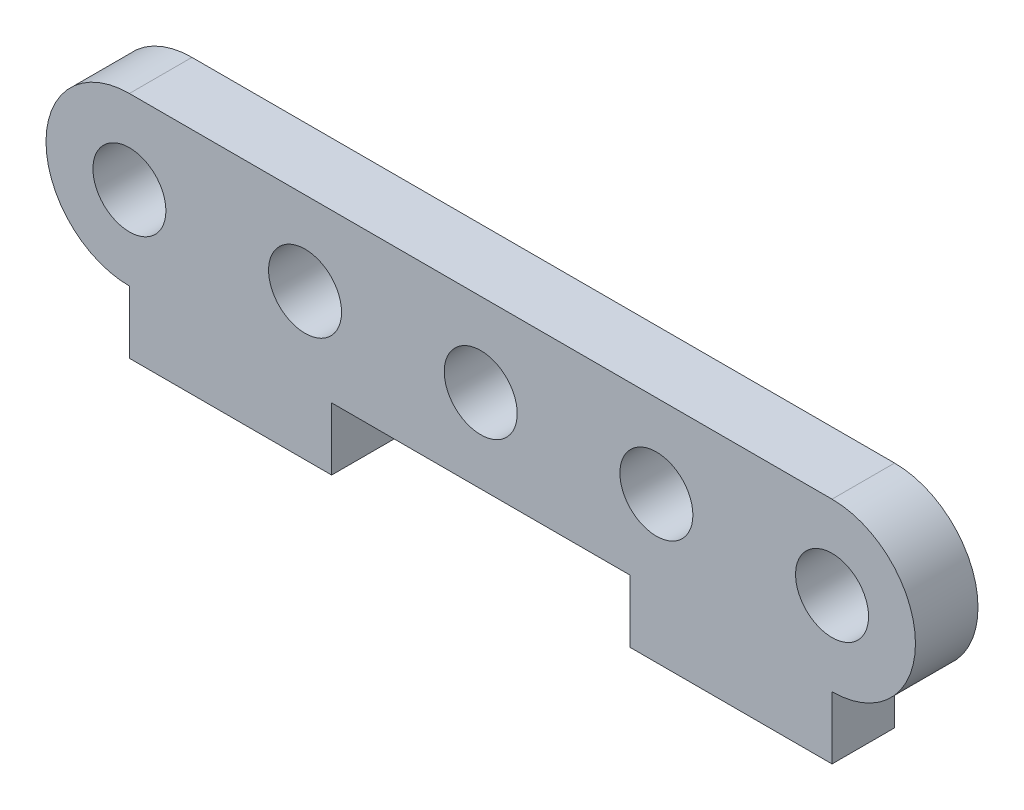
ISO-10303-21;
HEADER;
FILE_DESCRIPTION(('STEP AP214'),'2;1');
FILE_NAME('part.step','',(''),(''),'','','');
FILE_SCHEMA(('AUTOMOTIVE_DESIGN { 1 0 10303 214 1 1 1 1 }'));
ENDSEC;
DATA;
#1=APPLICATION_CONTEXT('core data for automotive mechanical design processes');
#2=APPLICATION_PROTOCOL_DEFINITION('international standard','automotive_design',2000,#1);
#3=PRODUCT_CONTEXT('',#1,'mechanical');
#4=PRODUCT('Part','Part','',(#3));
#5=PRODUCT_RELATED_PRODUCT_CATEGORY('part','',(#4));
#6=PRODUCT_DEFINITION_FORMATION('','',#4);
#7=PRODUCT_DEFINITION_CONTEXT('part definition',#1,'design');
#8=PRODUCT_DEFINITION('design','',#6,#7);
#9=PRODUCT_DEFINITION_SHAPE('','',#8);
#10=(LENGTH_UNIT() NAMED_UNIT(*) SI_UNIT(.MILLI.,.METRE.));
#11=(NAMED_UNIT(*) PLANE_ANGLE_UNIT() SI_UNIT($,.RADIAN.));
#12=(NAMED_UNIT(*) SI_UNIT($,.STERADIAN.) SOLID_ANGLE_UNIT());
#13=UNCERTAINTY_MEASURE_WITH_UNIT(LENGTH_MEASURE(1.E-05),#10,'distance_accuracy_value','');
#14=(GEOMETRIC_REPRESENTATION_CONTEXT(3) GLOBAL_UNCERTAINTY_ASSIGNED_CONTEXT((#13)) GLOBAL_UNIT_ASSIGNED_CONTEXT((#10,
#11,#12)) REPRESENTATION_CONTEXT('',''));
#15=CARTESIAN_POINT('',(0.,0.,0.));
#16=DIRECTION('',(0.,0.,1.));
#17=DIRECTION('',(1.,0.,0.));
#18=AXIS2_PLACEMENT_3D('',#15,#16,#17);
#19=CARTESIAN_POINT('',(16.85,0.,3.));
#20=DIRECTION('',(0.,0.,1.));
#21=DIRECTION('',(1.,0.,0.));
#22=AXIS2_PLACEMENT_3D('',#19,#20,#21);
#23=PLANE('',#22);
#24=CARTESIAN_POINT('',(8.425,0.,3.));
#25=DIRECTION('',(0.,0.,1.));
#26=DIRECTION('',(1.,0.,0.));
#27=AXIS2_PLACEMENT_3D('',#24,#25,#26);
#28=CIRCLE('',#27,1.75);
#29=CARTESIAN_POINT('',(10.175,0.,3.));
#30=VERTEX_POINT('',#29);
#31=EDGE_CURVE('E224',#30,#30,#28,.T.);
#32=ORIENTED_EDGE('',*,*,#31,.F.);
#33=EDGE_LOOP('',(#32));
#34=FACE_BOUND('',#33,.T.);
#35=CARTESIAN_POINT('',(0.,0.,3.));
#36=DIRECTION('',(0.,0.,1.));
#37=DIRECTION('',(1.,0.,0.));
#38=AXIS2_PLACEMENT_3D('',#35,#36,#37);
#39=CIRCLE('',#38,1.75);
#40=CARTESIAN_POINT('',(1.75,0.,3.));
#41=VERTEX_POINT('',#40);
#42=EDGE_CURVE('E212',#41,#41,#39,.T.);
#43=ORIENTED_EDGE('',*,*,#42,.F.);
#44=EDGE_LOOP('',(#43));
#45=FACE_BOUND('',#44,.T.);
#46=CARTESIAN_POINT('',(16.85,0.,3.));
#47=DIRECTION('',(0.,0.,1.));
#48=DIRECTION('',(1.,0.,0.));
#49=AXIS2_PLACEMENT_3D('',#46,#47,#48);
#50=CIRCLE('',#49,4.);
#51=CARTESIAN_POINT('',(16.85,-4.,3.));
#52=VERTEX_POINT('',#51);
#53=CARTESIAN_POINT('',(16.85,4.,3.));
#54=VERTEX_POINT('',#53);
#55=EDGE_CURVE('E161',#52,#54,#50,.T.);
#56=ORIENTED_EDGE('',*,*,#55,.T.);
#57=DIRECTION('',(-1.,0.,0.));
#58=VECTOR('',#57,1.);
#59=CARTESIAN_POINT('',(-16.85,4.,3.));
#60=LINE('',#59,#58);
#61=CARTESIAN_POINT('',(-16.85,4.,3.));
#62=VERTEX_POINT('',#61);
#63=EDGE_CURVE('E99',#54,#62,#60,.T.);
#64=ORIENTED_EDGE('',*,*,#63,.T.);
#65=CARTESIAN_POINT('',(-16.85,0.,3.));
#66=DIRECTION('',(0.,0.,1.));
#67=DIRECTION('',(1.,0.,0.));
#68=AXIS2_PLACEMENT_3D('',#65,#66,#67);
#69=CIRCLE('',#68,4.);
#70=CARTESIAN_POINT('',(-16.85,-4.,3.));
#71=VERTEX_POINT('',#70);
#72=EDGE_CURVE('E182',#62,#71,#69,.T.);
#73=ORIENTED_EDGE('',*,*,#72,.T.);
#74=DIRECTION('',(0.,-1.,0.));
#75=VECTOR('',#74,1.);
#76=CARTESIAN_POINT('',(-16.85,-4.,3.));
#77=LINE('',#76,#75);
#78=CARTESIAN_POINT('',(-16.85,-7.,3.));
#79=VERTEX_POINT('',#78);
#80=EDGE_CURVE('E201',#71,#79,#77,.T.);
#81=ORIENTED_EDGE('',*,*,#80,.T.);
#82=DIRECTION('',(1.,0.,0.));
#83=VECTOR('',#82,1.);
#84=CARTESIAN_POINT('',(-16.85,-7.,3.));
#85=LINE('',#84,#83);
#86=CARTESIAN_POINT('',(-7.14999999999999,-7.,3.));
#87=VERTEX_POINT('',#86);
#88=EDGE_CURVE('E198',#79,#87,#85,.T.);
#89=ORIENTED_EDGE('',*,*,#88,.T.);
#90=DIRECTION('',(0.,1.,0.));
#91=VECTOR('',#90,1.);
#92=CARTESIAN_POINT('',(-7.14999999999999,-4.,3.));
#93=LINE('',#92,#91);
#94=CARTESIAN_POINT('',(-7.14999999999999,-4.,3.));
#95=VERTEX_POINT('',#94);
#96=EDGE_CURVE('E200',#87,#95,#93,.T.);
#97=ORIENTED_EDGE('',*,*,#96,.T.);
#98=DIRECTION('',(1.,0.,0.));
#99=VECTOR('',#98,1.);
#100=CARTESIAN_POINT('',(-7.14999999999999,-4.,3.));
#101=LINE('',#100,#99);
#102=CARTESIAN_POINT('',(7.15000000000001,-4.,3.));
#103=VERTEX_POINT('',#102);
#104=EDGE_CURVE('E124',#95,#103,#101,.T.);
#105=ORIENTED_EDGE('',*,*,#104,.T.);
#106=DIRECTION('',(0.,-1.,0.));
#107=VECTOR('',#106,1.);
#108=CARTESIAN_POINT('',(7.15000000000001,-4.,3.));
#109=LINE('',#108,#107);
#110=CARTESIAN_POINT('',(7.15000000000001,-7.,3.));
#111=VERTEX_POINT('',#110);
#112=EDGE_CURVE('E118',#103,#111,#109,.T.);
#113=ORIENTED_EDGE('',*,*,#112,.T.);
#114=DIRECTION('',(1.,0.,0.));
#115=VECTOR('',#114,1.);
#116=CARTESIAN_POINT('',(7.15000000000001,-7.,3.));
#117=LINE('',#116,#115);
#118=CARTESIAN_POINT('',(16.85,-7.,3.));
#119=VERTEX_POINT('',#118);
#120=EDGE_CURVE('E122',#111,#119,#117,.T.);
#121=ORIENTED_EDGE('',*,*,#120,.T.);
#122=DIRECTION('',(0.,1.,0.));
#123=VECTOR('',#122,1.);
#124=CARTESIAN_POINT('',(16.85,-4.,3.));
#125=LINE('',#124,#123);
#126=EDGE_CURVE('E50',#119,#52,#125,.T.);
#127=ORIENTED_EDGE('',*,*,#126,.T.);
#128=EDGE_LOOP('',(#56,#64,#73,#81,#89,#97,#105,#113,#121,#127));
#129=FACE_BOUND('',#128,.T.);
#130=CARTESIAN_POINT('',(-16.85,0.,3.));
#131=DIRECTION('',(0.,0.,1.));
#132=DIRECTION('',(1.,0.,0.));
#133=AXIS2_PLACEMENT_3D('',#130,#131,#132);
#134=CIRCLE('',#133,1.75);
#135=CARTESIAN_POINT('',(-15.1,0.,3.));
#136=VERTEX_POINT('',#135);
#137=EDGE_CURVE('E146',#136,#136,#134,.T.);
#138=ORIENTED_EDGE('',*,*,#137,.F.);
#139=EDGE_LOOP('',(#138));
#140=FACE_BOUND('',#139,.T.);
#141=CARTESIAN_POINT('',(-8.425,0.,3.));
#142=DIRECTION('',(0.,0.,1.));
#143=DIRECTION('',(1.,0.,0.));
#144=AXIS2_PLACEMENT_3D('',#141,#142,#143);
#145=CIRCLE('',#144,1.75);
#146=CARTESIAN_POINT('',(-6.675,0.,3.));
#147=VERTEX_POINT('',#146);
#148=EDGE_CURVE('E218',#147,#147,#145,.T.);
#149=ORIENTED_EDGE('',*,*,#148,.F.);
#150=EDGE_LOOP('',(#149));
#151=FACE_BOUND('',#150,.T.);
#152=CARTESIAN_POINT('',(16.85,0.,3.));
#153=DIRECTION('',(0.,0.,1.));
#154=DIRECTION('',(1.,0.,0.));
#155=AXIS2_PLACEMENT_3D('',#152,#153,#154);
#156=CIRCLE('',#155,1.75);
#157=CARTESIAN_POINT('',(18.6,0.,3.));
#158=VERTEX_POINT('',#157);
#159=EDGE_CURVE('E230',#158,#158,#156,.T.);
#160=ORIENTED_EDGE('',*,*,#159,.F.);
#161=EDGE_LOOP('',(#160));
#162=FACE_BOUND('',#161,.T.);
#163=ADVANCED_FACE('F33',(#34,#45,#129,#140,#151,#162),#23,.T.);
#164=CARTESIAN_POINT('',(16.85,0.,0.));
#165=DIRECTION('',(0.,0.,1.));
#166=DIRECTION('',(1.,0.,0.));
#167=AXIS2_PLACEMENT_3D('',#164,#165,#166);
#168=PLANE('',#167);
#169=CARTESIAN_POINT('',(16.85,0.,0.));
#170=DIRECTION('',(0.,0.,1.));
#171=DIRECTION('',(1.,0.,0.));
#172=AXIS2_PLACEMENT_3D('',#169,#170,#171);
#173=CIRCLE('',#172,4.);
#174=CARTESIAN_POINT('',(16.85,-4.,0.));
#175=VERTEX_POINT('',#174);
#176=CARTESIAN_POINT('',(16.85,4.,0.));
#177=VERTEX_POINT('',#176);
#178=EDGE_CURVE('E142',#175,#177,#173,.T.);
#179=ORIENTED_EDGE('',*,*,#178,.F.);
#180=DIRECTION('',(0.,1.,0.));
#181=VECTOR('',#180,1.);
#182=CARTESIAN_POINT('',(16.85,-4.,0.));
#183=LINE('',#182,#181);
#184=CARTESIAN_POINT('',(16.85,-7.,0.));
#185=VERTEX_POINT('',#184);
#186=EDGE_CURVE('E91',#185,#175,#183,.T.);
#187=ORIENTED_EDGE('',*,*,#186,.F.);
#188=DIRECTION('',(1.,0.,0.));
#189=VECTOR('',#188,1.);
#190=CARTESIAN_POINT('',(7.15000000000001,-7.,0.));
#191=LINE('',#190,#189);
#192=CARTESIAN_POINT('',(7.15000000000001,-7.,0.));
#193=VERTEX_POINT('',#192);
#194=EDGE_CURVE('E85',#193,#185,#191,.T.);
#195=ORIENTED_EDGE('',*,*,#194,.F.);
#196=DIRECTION('',(0.,-1.,0.));
#197=VECTOR('',#196,1.);
#198=CARTESIAN_POINT('',(7.15000000000001,-4.,0.));
#199=LINE('',#198,#197);
#200=CARTESIAN_POINT('',(7.15000000000001,-4.,0.));
#201=VERTEX_POINT('',#200);
#202=EDGE_CURVE('E132',#201,#193,#199,.T.);
#203=ORIENTED_EDGE('',*,*,#202,.F.);
#204=DIRECTION('',(1.,0.,0.));
#205=VECTOR('',#204,1.);
#206=CARTESIAN_POINT('',(-7.14999999999999,-4.,0.));
#207=LINE('',#206,#205);
#208=CARTESIAN_POINT('',(-7.14999999999999,-4.,0.));
#209=VERTEX_POINT('',#208);
#210=EDGE_CURVE('E156',#209,#201,#207,.T.);
#211=ORIENTED_EDGE('',*,*,#210,.F.);
#212=DIRECTION('',(0.,1.,0.));
#213=VECTOR('',#212,1.);
#214=CARTESIAN_POINT('',(-7.14999999999999,-4.,0.));
#215=LINE('',#214,#213);
#216=CARTESIAN_POINT('',(-7.14999999999999,-7.,0.));
#217=VERTEX_POINT('',#216);
#218=EDGE_CURVE('E154',#217,#209,#215,.T.);
#219=ORIENTED_EDGE('',*,*,#218,.F.);
#220=DIRECTION('',(1.,0.,0.));
#221=VECTOR('',#220,1.);
#222=CARTESIAN_POINT('',(-16.85,-7.,0.));
#223=LINE('',#222,#221);
#224=CARTESIAN_POINT('',(-16.85,-7.,0.));
#225=VERTEX_POINT('',#224);
#226=EDGE_CURVE('E152',#225,#217,#223,.T.);
#227=ORIENTED_EDGE('',*,*,#226,.F.);
#228=DIRECTION('',(0.,-1.,0.));
#229=VECTOR('',#228,1.);
#230=CARTESIAN_POINT('',(-16.85,-4.,0.));
#231=LINE('',#230,#229);
#232=CARTESIAN_POINT('',(-16.85,-4.,0.));
#233=VERTEX_POINT('',#232);
#234=EDGE_CURVE('E150',#233,#225,#231,.T.);
#235=ORIENTED_EDGE('',*,*,#234,.F.);
#236=CARTESIAN_POINT('',(-16.85,0.,0.));
#237=DIRECTION('',(0.,0.,1.));
#238=DIRECTION('',(1.,0.,0.));
#239=AXIS2_PLACEMENT_3D('',#236,#237,#238);
#240=CIRCLE('',#239,4.);
#241=CARTESIAN_POINT('',(-16.85,4.,0.));
#242=VERTEX_POINT('',#241);
#243=EDGE_CURVE('E148',#242,#233,#240,.T.);
#244=ORIENTED_EDGE('',*,*,#243,.F.);
#245=DIRECTION('',(-1.,0.,0.));
#246=VECTOR('',#245,1.);
#247=CARTESIAN_POINT('',(-16.85,4.,0.));
#248=LINE('',#247,#246);
#249=EDGE_CURVE('E145',#177,#242,#248,.T.);
#250=ORIENTED_EDGE('',*,*,#249,.F.);
#251=EDGE_LOOP('',(#179,#187,#195,#203,#211,#219,#227,#235,#244,#250));
#252=FACE_BOUND('',#251,.T.);
#253=CARTESIAN_POINT('',(-16.85,0.,0.));
#254=DIRECTION('',(0.,0.,1.));
#255=DIRECTION('',(1.,0.,0.));
#256=AXIS2_PLACEMENT_3D('',#253,#254,#255);
#257=CIRCLE('',#256,1.75);
#258=CARTESIAN_POINT('',(-15.1,0.,0.));
#259=VERTEX_POINT('',#258);
#260=EDGE_CURVE('E209',#259,#259,#257,.T.);
#261=ORIENTED_EDGE('',*,*,#260,.T.);
#262=EDGE_LOOP('',(#261));
#263=FACE_BOUND('',#262,.T.);
#264=CARTESIAN_POINT('',(0.,0.,0.));
#265=DIRECTION('',(0.,0.,1.));
#266=DIRECTION('',(1.,0.,0.));
#267=AXIS2_PLACEMENT_3D('',#264,#265,#266);
#268=CIRCLE('',#267,1.75);
#269=CARTESIAN_POINT('',(1.75,0.,0.));
#270=VERTEX_POINT('',#269);
#271=EDGE_CURVE('E215',#270,#270,#268,.T.);
#272=ORIENTED_EDGE('',*,*,#271,.T.);
#273=EDGE_LOOP('',(#272));
#274=FACE_BOUND('',#273,.T.);
#275=CARTESIAN_POINT('',(-8.425,0.,0.));
#276=DIRECTION('',(0.,0.,1.));
#277=DIRECTION('',(1.,0.,0.));
#278=AXIS2_PLACEMENT_3D('',#275,#276,#277);
#279=CIRCLE('',#278,1.75);
#280=CARTESIAN_POINT('',(-6.675,0.,0.));
#281=VERTEX_POINT('',#280);
#282=EDGE_CURVE('E221',#281,#281,#279,.T.);
#283=ORIENTED_EDGE('',*,*,#282,.T.);
#284=EDGE_LOOP('',(#283));
#285=FACE_BOUND('',#284,.T.);
#286=CARTESIAN_POINT('',(8.425,0.,0.));
#287=DIRECTION('',(0.,0.,1.));
#288=DIRECTION('',(1.,0.,0.));
#289=AXIS2_PLACEMENT_3D('',#286,#287,#288);
#290=CIRCLE('',#289,1.75);
#291=CARTESIAN_POINT('',(10.175,0.,0.));
#292=VERTEX_POINT('',#291);
#293=EDGE_CURVE('E227',#292,#292,#290,.T.);
#294=ORIENTED_EDGE('',*,*,#293,.T.);
#295=EDGE_LOOP('',(#294));
#296=FACE_BOUND('',#295,.T.);
#297=CARTESIAN_POINT('',(16.85,0.,0.));
#298=DIRECTION('',(0.,0.,1.));
#299=DIRECTION('',(1.,0.,0.));
#300=AXIS2_PLACEMENT_3D('',#297,#298,#299);
#301=CIRCLE('',#300,1.75);
#302=CARTESIAN_POINT('',(18.6,0.,0.));
#303=VERTEX_POINT('',#302);
#304=EDGE_CURVE('E233',#303,#303,#301,.T.);
#305=ORIENTED_EDGE('',*,*,#304,.T.);
#306=EDGE_LOOP('',(#305));
#307=FACE_BOUND('',#306,.T.);
#308=ADVANCED_FACE('F186',(#252,#263,#274,#285,#296,#307),#168,.F.);
#309=CARTESIAN_POINT('',(16.85,0.,3.));
#310=DIRECTION('',(0.,0.,-1.));
#311=DIRECTION('',(-1.,0.,0.));
#312=AXIS2_PLACEMENT_3D('',#309,#310,#311);
#313=CYLINDRICAL_SURFACE('',#312,4.);
#314=ORIENTED_EDGE('',*,*,#178,.T.);
#315=DIRECTION('',(0.,0.,-1.));
#316=VECTOR('',#315,1.);
#317=CARTESIAN_POINT('',(16.85,4.,3.));
#318=LINE('',#317,#316);
#319=EDGE_CURVE('E11',#54,#177,#318,.T.);
#320=ORIENTED_EDGE('',*,*,#319,.F.);
#321=ORIENTED_EDGE('',*,*,#55,.F.);
#322=DIRECTION('',(0.,0.,-1.));
#323=VECTOR('',#322,1.);
#324=CARTESIAN_POINT('',(16.85,-4.,3.));
#325=LINE('',#324,#323);
#326=EDGE_CURVE('E138',#52,#175,#325,.T.);
#327=ORIENTED_EDGE('',*,*,#326,.T.);
#328=EDGE_LOOP('',(#314,#320,#321,#327));
#329=FACE_BOUND('',#328,.T.);
#330=ADVANCED_FACE('F35',(#329),#313,.T.);
#331=CARTESIAN_POINT('',(-16.85,4.,3.));
#332=DIRECTION('',(0.,-1.,0.));
#333=DIRECTION('',(1.,0.,0.));
#334=AXIS2_PLACEMENT_3D('',#331,#332,#333);
#335=PLANE('',#334);
#336=ORIENTED_EDGE('',*,*,#249,.T.);
#337=DIRECTION('',(0.,0.,-1.));
#338=VECTOR('',#337,1.);
#339=CARTESIAN_POINT('',(-16.85,4.,3.));
#340=LINE('',#339,#338);
#341=EDGE_CURVE('E42',#62,#242,#340,.T.);
#342=ORIENTED_EDGE('',*,*,#341,.F.);
#343=ORIENTED_EDGE('',*,*,#63,.F.);
#344=ORIENTED_EDGE('',*,*,#319,.T.);
#345=EDGE_LOOP('',(#336,#342,#343,#344));
#346=FACE_BOUND('',#345,.T.);
#347=ADVANCED_FACE('F275',(#346),#335,.F.);
#348=CARTESIAN_POINT('',(-16.85,0.,3.));
#349=DIRECTION('',(0.,0.,-1.));
#350=DIRECTION('',(-1.,0.,0.));
#351=AXIS2_PLACEMENT_3D('',#348,#349,#350);
#352=CYLINDRICAL_SURFACE('',#351,4.);
#353=ORIENTED_EDGE('',*,*,#243,.T.);
#354=DIRECTION('',(0.,0.,-1.));
#355=VECTOR('',#354,1.);
#356=CARTESIAN_POINT('',(-16.85,-4.,3.));
#357=LINE('',#356,#355);
#358=EDGE_CURVE('E174',#71,#233,#357,.T.);
#359=ORIENTED_EDGE('',*,*,#358,.F.);
#360=ORIENTED_EDGE('',*,*,#72,.F.);
#361=ORIENTED_EDGE('',*,*,#341,.T.);
#362=EDGE_LOOP('',(#353,#359,#360,#361));
#363=FACE_BOUND('',#362,.T.);
#364=ADVANCED_FACE('F180',(#363),#352,.T.);
#365=CARTESIAN_POINT('',(-16.85,-4.,3.));
#366=DIRECTION('',(1.,0.,0.));
#367=DIRECTION('',(0.,0.,-1.));
#368=AXIS2_PLACEMENT_3D('',#365,#366,#367);
#369=PLANE('',#368);
#370=ORIENTED_EDGE('',*,*,#234,.T.);
#371=DIRECTION('',(0.,0.,-1.));
#372=VECTOR('',#371,1.);
#373=CARTESIAN_POINT('',(-16.85,-7.,3.));
#374=LINE('',#373,#372);
#375=EDGE_CURVE('E171',#79,#225,#374,.T.);
#376=ORIENTED_EDGE('',*,*,#375,.F.);
#377=ORIENTED_EDGE('',*,*,#80,.F.);
#378=ORIENTED_EDGE('',*,*,#358,.T.);
#379=EDGE_LOOP('',(#370,#376,#377,#378));
#380=FACE_BOUND('',#379,.T.);
#381=ADVANCED_FACE('F192',(#380),#369,.F.);
#382=CARTESIAN_POINT('',(-16.85,-7.,3.));
#383=DIRECTION('',(0.,1.,0.));
#384=DIRECTION('',(0.,0.,1.));
#385=AXIS2_PLACEMENT_3D('',#382,#383,#384);
#386=PLANE('',#385);
#387=ORIENTED_EDGE('',*,*,#226,.T.);
#388=DIRECTION('',(0.,0.,-1.));
#389=VECTOR('',#388,1.);
#390=CARTESIAN_POINT('',(-7.14999999999999,-7.,3.));
#391=LINE('',#390,#389);
#392=EDGE_CURVE('E168',#87,#217,#391,.T.);
#393=ORIENTED_EDGE('',*,*,#392,.F.);
#394=ORIENTED_EDGE('',*,*,#88,.F.);
#395=ORIENTED_EDGE('',*,*,#375,.T.);
#396=EDGE_LOOP('',(#387,#393,#394,#395));
#397=FACE_BOUND('',#396,.T.);
#398=ADVANCED_FACE('F196',(#397),#386,.F.);
#399=CARTESIAN_POINT('',(-7.14999999999999,-4.,3.));
#400=DIRECTION('',(-1.,0.,0.));
#401=DIRECTION('',(0.,0.,1.));
#402=AXIS2_PLACEMENT_3D('',#399,#400,#401);
#403=PLANE('',#402);
#404=ORIENTED_EDGE('',*,*,#218,.T.);
#405=DIRECTION('',(0.,0.,-1.));
#406=VECTOR('',#405,1.);
#407=CARTESIAN_POINT('',(-7.14999999999999,-4.,3.));
#408=LINE('',#407,#406);
#409=EDGE_CURVE('E165',#95,#209,#408,.T.);
#410=ORIENTED_EDGE('',*,*,#409,.F.);
#411=ORIENTED_EDGE('',*,*,#96,.F.);
#412=ORIENTED_EDGE('',*,*,#392,.T.);
#413=EDGE_LOOP('',(#404,#410,#411,#412));
#414=FACE_BOUND('',#413,.T.);
#415=ADVANCED_FACE('F265',(#414),#403,.F.);
#416=CARTESIAN_POINT('',(-7.14999999999999,-4.,3.));
#417=DIRECTION('',(0.,1.,0.));
#418=DIRECTION('',(0.,0.,1.));
#419=AXIS2_PLACEMENT_3D('',#416,#417,#418);
#420=PLANE('',#419);
#421=ORIENTED_EDGE('',*,*,#210,.T.);
#422=DIRECTION('',(0.,0.,-1.));
#423=VECTOR('',#422,1.);
#424=CARTESIAN_POINT('',(7.15000000000001,-4.,3.));
#425=LINE('',#424,#423);
#426=EDGE_CURVE('E133',#103,#201,#425,.T.);
#427=ORIENTED_EDGE('',*,*,#426,.F.);
#428=ORIENTED_EDGE('',*,*,#104,.F.);
#429=ORIENTED_EDGE('',*,*,#409,.T.);
#430=EDGE_LOOP('',(#421,#427,#428,#429));
#431=FACE_BOUND('',#430,.T.);
#432=ADVANCED_FACE('F262',(#431),#420,.F.);
#433=CARTESIAN_POINT('',(7.15000000000001,-4.,3.));
#434=DIRECTION('',(1.,0.,0.));
#435=DIRECTION('',(0.,0.,-1.));
#436=AXIS2_PLACEMENT_3D('',#433,#434,#435);
#437=PLANE('',#436);
#438=ORIENTED_EDGE('',*,*,#202,.T.);
#439=DIRECTION('',(0.,0.,-1.));
#440=VECTOR('',#439,1.);
#441=CARTESIAN_POINT('',(7.15000000000001,-7.,3.));
#442=LINE('',#441,#440);
#443=EDGE_CURVE('E129',#111,#193,#442,.T.);
#444=ORIENTED_EDGE('',*,*,#443,.F.);
#445=ORIENTED_EDGE('',*,*,#112,.F.);
#446=ORIENTED_EDGE('',*,*,#426,.T.);
#447=EDGE_LOOP('',(#438,#444,#445,#446));
#448=FACE_BOUND('',#447,.T.);
#449=ADVANCED_FACE('F130',(#448),#437,.F.);
#450=CARTESIAN_POINT('',(7.15000000000001,-7.,3.));
#451=DIRECTION('',(0.,1.,0.));
#452=DIRECTION('',(-1.,0.,0.));
#453=AXIS2_PLACEMENT_3D('',#450,#451,#452);
#454=PLANE('',#453);
#455=ORIENTED_EDGE('',*,*,#194,.T.);
#456=DIRECTION('',(0.,0.,-1.));
#457=VECTOR('',#456,1.);
#458=CARTESIAN_POINT('',(16.85,-7.,3.));
#459=LINE('',#458,#457);
#460=EDGE_CURVE('E134',#119,#185,#459,.T.);
#461=ORIENTED_EDGE('',*,*,#460,.F.);
#462=ORIENTED_EDGE('',*,*,#120,.F.);
#463=ORIENTED_EDGE('',*,*,#443,.T.);
#464=EDGE_LOOP('',(#455,#461,#462,#463));
#465=FACE_BOUND('',#464,.T.);
#466=ADVANCED_FACE('F136',(#465),#454,.F.);
#467=CARTESIAN_POINT('',(16.85,-4.,3.));
#468=DIRECTION('',(-1.,0.,0.));
#469=DIRECTION('',(0.,0.,1.));
#470=AXIS2_PLACEMENT_3D('',#467,#468,#469);
#471=PLANE('',#470);
#472=ORIENTED_EDGE('',*,*,#186,.T.);
#473=ORIENTED_EDGE('',*,*,#326,.F.);
#474=ORIENTED_EDGE('',*,*,#126,.F.);
#475=ORIENTED_EDGE('',*,*,#460,.T.);
#476=EDGE_LOOP('',(#472,#473,#474,#475));
#477=FACE_BOUND('',#476,.T.);
#478=ADVANCED_FACE('F255',(#477),#471,.F.);
#479=CARTESIAN_POINT('',(-16.85,0.,3.));
#480=DIRECTION('',(0.,0.,-1.));
#481=DIRECTION('',(-1.,0.,0.));
#482=AXIS2_PLACEMENT_3D('',#479,#480,#481);
#483=CYLINDRICAL_SURFACE('',#482,1.75);
#484=ORIENTED_EDGE('',*,*,#137,.T.);
#485=EDGE_LOOP('',(#484));
#486=FACE_BOUND('',#485,.T.);
#487=ORIENTED_EDGE('',*,*,#260,.F.);
#488=EDGE_LOOP('',(#487));
#489=FACE_BOUND('',#488,.T.);
#490=ADVANCED_FACE('F252',(#486,#489),#483,.F.);
#491=CARTESIAN_POINT('',(0.,0.,3.));
#492=DIRECTION('',(0.,0.,-1.));
#493=DIRECTION('',(-1.,0.,0.));
#494=AXIS2_PLACEMENT_3D('',#491,#492,#493);
#495=CYLINDRICAL_SURFACE('',#494,1.75);
#496=ORIENTED_EDGE('',*,*,#42,.T.);
#497=EDGE_LOOP('',(#496));
#498=FACE_BOUND('',#497,.T.);
#499=ORIENTED_EDGE('',*,*,#271,.F.);
#500=EDGE_LOOP('',(#499));
#501=FACE_BOUND('',#500,.T.);
#502=ADVANCED_FACE('F351',(#498,#501),#495,.F.);
#503=CARTESIAN_POINT('',(-8.425,0.,3.));
#504=DIRECTION('',(0.,0.,-1.));
#505=DIRECTION('',(-1.,0.,0.));
#506=AXIS2_PLACEMENT_3D('',#503,#504,#505);
#507=CYLINDRICAL_SURFACE('',#506,1.75);
#508=ORIENTED_EDGE('',*,*,#148,.T.);
#509=EDGE_LOOP('',(#508));
#510=FACE_BOUND('',#509,.T.);
#511=ORIENTED_EDGE('',*,*,#282,.F.);
#512=EDGE_LOOP('',(#511));
#513=FACE_BOUND('',#512,.T.);
#514=ADVANCED_FACE('F359',(#510,#513),#507,.F.);
#515=CARTESIAN_POINT('',(8.425,0.,3.));
#516=DIRECTION('',(0.,0.,-1.));
#517=DIRECTION('',(-1.,0.,0.));
#518=AXIS2_PLACEMENT_3D('',#515,#516,#517);
#519=CYLINDRICAL_SURFACE('',#518,1.75);
#520=ORIENTED_EDGE('',*,*,#31,.T.);
#521=EDGE_LOOP('',(#520));
#522=FACE_BOUND('',#521,.T.);
#523=ORIENTED_EDGE('',*,*,#293,.F.);
#524=EDGE_LOOP('',(#523));
#525=FACE_BOUND('',#524,.T.);
#526=ADVANCED_FACE('F367',(#522,#525),#519,.F.);
#527=CARTESIAN_POINT('',(16.85,0.,3.));
#528=DIRECTION('',(0.,0.,-1.));
#529=DIRECTION('',(-1.,0.,0.));
#530=AXIS2_PLACEMENT_3D('',#527,#528,#529);
#531=CYLINDRICAL_SURFACE('',#530,1.75);
#532=ORIENTED_EDGE('',*,*,#159,.T.);
#533=EDGE_LOOP('',(#532));
#534=FACE_BOUND('',#533,.T.);
#535=ORIENTED_EDGE('',*,*,#304,.F.);
#536=EDGE_LOOP('',(#535));
#537=FACE_BOUND('',#536,.T.);
#538=ADVANCED_FACE('F239',(#534,#537),#531,.F.);
#539=CLOSED_SHELL('',(#163,#308,#330,#347,#364,#381,#398,#415,#432,#449,#466,#478,#490,#502,
#514,#526,#538));
#540=MANIFOLD_SOLID_BREP('B2',#539);
#541=ADVANCED_BREP_SHAPE_REPRESENTATION('',(#18,#540),#14);
#542=SHAPE_DEFINITION_REPRESENTATION(#9,#541);
ENDSEC;
END-ISO-10303-21;
